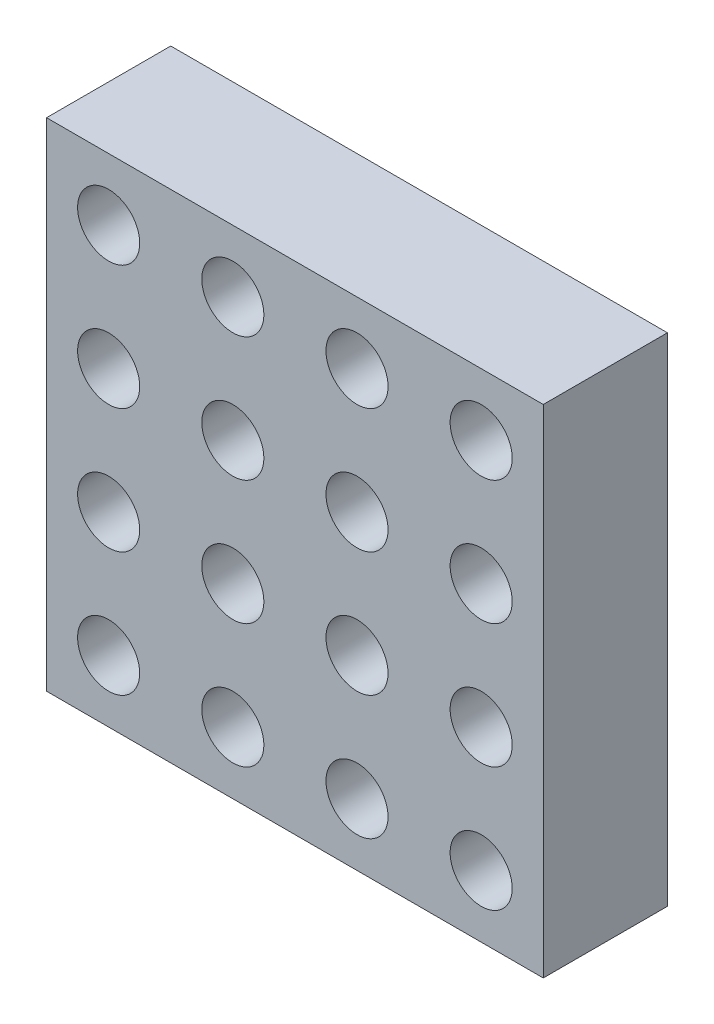
ISO-10303-21;
HEADER;
FILE_DESCRIPTION(('STEP AP214'),'2;1');
FILE_NAME('part.step','',(''),(''),'','','');
FILE_SCHEMA(('AUTOMOTIVE_DESIGN { 1 0 10303 214 1 1 1 1 }'));
ENDSEC;
DATA;
#1=APPLICATION_CONTEXT('core data for automotive mechanical design processes');
#2=APPLICATION_PROTOCOL_DEFINITION('international standard','automotive_design',2000,#1);
#3=PRODUCT_CONTEXT('',#1,'mechanical');
#4=PRODUCT('Part','Part','',(#3));
#5=PRODUCT_RELATED_PRODUCT_CATEGORY('part','',(#4));
#6=PRODUCT_DEFINITION_FORMATION('','',#4);
#7=PRODUCT_DEFINITION_CONTEXT('part definition',#1,'design');
#8=PRODUCT_DEFINITION('design','',#6,#7);
#9=PRODUCT_DEFINITION_SHAPE('','',#8);
#10=(LENGTH_UNIT() NAMED_UNIT(*) SI_UNIT(.MILLI.,.METRE.));
#11=(NAMED_UNIT(*) PLANE_ANGLE_UNIT() SI_UNIT($,.RADIAN.));
#12=(NAMED_UNIT(*) SI_UNIT($,.STERADIAN.) SOLID_ANGLE_UNIT());
#13=UNCERTAINTY_MEASURE_WITH_UNIT(LENGTH_MEASURE(1.E-05),#10,'distance_accuracy_value','');
#14=(GEOMETRIC_REPRESENTATION_CONTEXT(3) GLOBAL_UNCERTAINTY_ASSIGNED_CONTEXT((#13)) GLOBAL_UNIT_ASSIGNED_CONTEXT((#10,
#11,#12)) REPRESENTATION_CONTEXT('',''));
#15=CARTESIAN_POINT('',(0.,0.,0.));
#16=DIRECTION('',(0.,0.,1.));
#17=DIRECTION('',(1.,0.,0.));
#18=AXIS2_PLACEMENT_3D('',#15,#16,#17);
#19=CARTESIAN_POINT('',(20.,20.,10.));
#20=DIRECTION('',(-1.,0.,0.));
#21=DIRECTION('',(0.,-1.,0.));
#22=AXIS2_PLACEMENT_3D('',#19,#20,#21);
#23=PLANE('',#22);
#24=DIRECTION('',(0.,1.,0.));
#25=VECTOR('',#24,1.);
#26=CARTESIAN_POINT('',(20.,20.,0.));
#27=LINE('',#26,#25);
#28=CARTESIAN_POINT('',(20.,-20.,0.));
#29=VERTEX_POINT('',#28);
#30=CARTESIAN_POINT('',(20.,20.,0.));
#31=VERTEX_POINT('',#30);
#32=EDGE_CURVE('E104',#29,#31,#27,.T.);
#33=ORIENTED_EDGE('',*,*,#32,.T.);
#34=DIRECTION('',(0.,0.,-1.));
#35=VECTOR('',#34,1.);
#36=CARTESIAN_POINT('',(20.,20.,10.));
#37=LINE('',#36,#35);
#38=CARTESIAN_POINT('',(20.,20.,10.));
#39=VERTEX_POINT('',#38);
#40=EDGE_CURVE('E95',#39,#31,#37,.T.);
#41=ORIENTED_EDGE('',*,*,#40,.F.);
#42=DIRECTION('',(0.,1.,0.));
#43=VECTOR('',#42,1.);
#44=CARTESIAN_POINT('',(20.,20.,10.));
#45=LINE('',#44,#43);
#46=CARTESIAN_POINT('',(20.,-20.,10.));
#47=VERTEX_POINT('',#46);
#48=EDGE_CURVE('E89',#47,#39,#45,.T.);
#49=ORIENTED_EDGE('',*,*,#48,.F.);
#50=DIRECTION('',(0.,0.,-1.));
#51=VECTOR('',#50,1.);
#52=CARTESIAN_POINT('',(20.,-20.,10.));
#53=LINE('',#52,#51);
#54=EDGE_CURVE('E100',#47,#29,#53,.T.);
#55=ORIENTED_EDGE('',*,*,#54,.T.);
#56=EDGE_LOOP('',(#33,#41,#49,#55));
#57=FACE_BOUND('',#56,.T.);
#58=ADVANCED_FACE('F35',(#57),#23,.F.);
#59=CARTESIAN_POINT('',(-20.,20.,10.));
#60=DIRECTION('',(0.,-1.,0.));
#61=DIRECTION('',(0.,0.,-1.));
#62=AXIS2_PLACEMENT_3D('',#59,#60,#61);
#63=PLANE('',#62);
#64=DIRECTION('',(-1.,0.,0.));
#65=VECTOR('',#64,1.);
#66=CARTESIAN_POINT('',(-20.,20.,0.));
#67=LINE('',#66,#65);
#68=CARTESIAN_POINT('',(-20.,20.,0.));
#69=VERTEX_POINT('',#68);
#70=EDGE_CURVE('E94',#31,#69,#67,.T.);
#71=ORIENTED_EDGE('',*,*,#70,.T.);
#72=DIRECTION('',(0.,0.,-1.));
#73=VECTOR('',#72,1.);
#74=CARTESIAN_POINT('',(-20.,20.,10.));
#75=LINE('',#74,#73);
#76=CARTESIAN_POINT('',(-20.,20.,10.));
#77=VERTEX_POINT('',#76);
#78=EDGE_CURVE('E92',#77,#69,#75,.T.);
#79=ORIENTED_EDGE('',*,*,#78,.F.);
#80=DIRECTION('',(-1.,0.,0.));
#81=VECTOR('',#80,1.);
#82=CARTESIAN_POINT('',(-20.,20.,10.));
#83=LINE('',#82,#81);
#84=EDGE_CURVE('E83',#39,#77,#83,.T.);
#85=ORIENTED_EDGE('',*,*,#84,.F.);
#86=ORIENTED_EDGE('',*,*,#40,.T.);
#87=EDGE_LOOP('',(#71,#79,#85,#86));
#88=FACE_BOUND('',#87,.T.);
#89=ADVANCED_FACE('F93',(#88),#63,.F.);
#90=CARTESIAN_POINT('',(-20.,20.,10.));
#91=DIRECTION('',(1.,0.,0.));
#92=DIRECTION('',(0.,0.,-1.));
#93=AXIS2_PLACEMENT_3D('',#90,#91,#92);
#94=PLANE('',#93);
#95=DIRECTION('',(0.,-1.,0.));
#96=VECTOR('',#95,1.);
#97=CARTESIAN_POINT('',(-20.,20.,0.));
#98=LINE('',#97,#96);
#99=CARTESIAN_POINT('',(-20.,-20.,0.));
#100=VERTEX_POINT('',#99);
#101=EDGE_CURVE('E69',#69,#100,#98,.T.);
#102=ORIENTED_EDGE('',*,*,#101,.T.);
#103=DIRECTION('',(0.,0.,-1.));
#104=VECTOR('',#103,1.);
#105=CARTESIAN_POINT('',(-20.,-20.,10.));
#106=LINE('',#105,#104);
#107=CARTESIAN_POINT('',(-20.,-20.,10.));
#108=VERTEX_POINT('',#107);
#109=EDGE_CURVE('E96',#108,#100,#106,.T.);
#110=ORIENTED_EDGE('',*,*,#109,.F.);
#111=DIRECTION('',(0.,-1.,0.));
#112=VECTOR('',#111,1.);
#113=CARTESIAN_POINT('',(-20.,20.,10.));
#114=LINE('',#113,#112);
#115=EDGE_CURVE('E87',#77,#108,#114,.T.);
#116=ORIENTED_EDGE('',*,*,#115,.F.);
#117=ORIENTED_EDGE('',*,*,#78,.T.);
#118=EDGE_LOOP('',(#102,#110,#116,#117));
#119=FACE_BOUND('',#118,.T.);
#120=ADVANCED_FACE('F98',(#119),#94,.F.);
#121=CARTESIAN_POINT('',(-20.,-20.,10.));
#122=DIRECTION('',(0.,1.,0.));
#123=DIRECTION('',(0.,0.,1.));
#124=AXIS2_PLACEMENT_3D('',#121,#122,#123);
#125=PLANE('',#124);
#126=DIRECTION('',(1.,0.,0.));
#127=VECTOR('',#126,1.);
#128=CARTESIAN_POINT('',(-20.,-20.,0.));
#129=LINE('',#128,#127);
#130=EDGE_CURVE('E75',#100,#29,#129,.T.);
#131=ORIENTED_EDGE('',*,*,#130,.T.);
#132=ORIENTED_EDGE('',*,*,#54,.F.);
#133=DIRECTION('',(1.,0.,0.));
#134=VECTOR('',#133,1.);
#135=CARTESIAN_POINT('',(-20.,-20.,10.));
#136=LINE('',#135,#134);
#137=EDGE_CURVE('E52',#108,#47,#136,.T.);
#138=ORIENTED_EDGE('',*,*,#137,.F.);
#139=ORIENTED_EDGE('',*,*,#109,.T.);
#140=EDGE_LOOP('',(#131,#132,#138,#139));
#141=FACE_BOUND('',#140,.T.);
#142=ADVANCED_FACE('F202',(#141),#125,.F.);
#143=CARTESIAN_POINT('',(0.,0.,10.));
#144=DIRECTION('',(0.,0.,1.));
#145=DIRECTION('',(1.,0.,0.));
#146=AXIS2_PLACEMENT_3D('',#143,#144,#145);
#147=PLANE('',#146);
#148=CARTESIAN_POINT('',(5.,15.,10.));
#149=DIRECTION('',(0.,0.,1.));
#150=DIRECTION('',(1.,0.,0.));
#151=AXIS2_PLACEMENT_3D('',#148,#149,#150);
#152=CIRCLE('',#151,2.5);
#153=CARTESIAN_POINT('',(7.5,15.,10.));
#154=VERTEX_POINT('',#153);
#155=EDGE_CURVE('E420',#154,#154,#152,.T.);
#156=ORIENTED_EDGE('',*,*,#155,.F.);
#157=EDGE_LOOP('',(#156));
#158=FACE_BOUND('',#157,.T.);
#159=CARTESIAN_POINT('',(15.,15.,10.));
#160=DIRECTION('',(0.,0.,1.));
#161=DIRECTION('',(1.,0.,0.));
#162=AXIS2_PLACEMENT_3D('',#159,#160,#161);
#163=CIRCLE('',#162,2.5);
#164=CARTESIAN_POINT('',(17.5,15.,10.));
#165=VERTEX_POINT('',#164);
#166=EDGE_CURVE('E419',#165,#165,#163,.T.);
#167=ORIENTED_EDGE('',*,*,#166,.F.);
#168=EDGE_LOOP('',(#167));
#169=FACE_BOUND('',#168,.T.);
#170=ORIENTED_EDGE('',*,*,#48,.T.);
#171=ORIENTED_EDGE('',*,*,#84,.T.);
#172=ORIENTED_EDGE('',*,*,#115,.T.);
#173=ORIENTED_EDGE('',*,*,#137,.T.);
#174=EDGE_LOOP('',(#170,#171,#172,#173));
#175=FACE_BOUND('',#174,.T.);
#176=CARTESIAN_POINT('',(-5.,15.,10.));
#177=DIRECTION('',(0.,0.,1.));
#178=DIRECTION('',(1.,0.,0.));
#179=AXIS2_PLACEMENT_3D('',#176,#177,#178);
#180=CIRCLE('',#179,2.5);
#181=CARTESIAN_POINT('',(-2.5,15.,10.));
#182=VERTEX_POINT('',#181);
#183=EDGE_CURVE('E117',#182,#182,#180,.T.);
#184=ORIENTED_EDGE('',*,*,#183,.F.);
#185=EDGE_LOOP('',(#184));
#186=FACE_BOUND('',#185,.T.);
#187=CARTESIAN_POINT('',(-15.,15.,10.));
#188=DIRECTION('',(0.,0.,1.));
#189=DIRECTION('',(1.,0.,0.));
#190=AXIS2_PLACEMENT_3D('',#187,#188,#189);
#191=CIRCLE('',#190,2.5);
#192=CARTESIAN_POINT('',(-12.5,15.,10.));
#193=VERTEX_POINT('',#192);
#194=EDGE_CURVE('E123',#193,#193,#191,.T.);
#195=ORIENTED_EDGE('',*,*,#194,.F.);
#196=EDGE_LOOP('',(#195));
#197=FACE_BOUND('',#196,.T.);
#198=CARTESIAN_POINT('',(15.,5.,10.));
#199=DIRECTION('',(0.,0.,1.));
#200=DIRECTION('',(1.,0.,0.));
#201=AXIS2_PLACEMENT_3D('',#198,#199,#200);
#202=CIRCLE('',#201,2.5);
#203=CARTESIAN_POINT('',(17.5,5.,10.));
#204=VERTEX_POINT('',#203);
#205=EDGE_CURVE('E129',#204,#204,#202,.T.);
#206=ORIENTED_EDGE('',*,*,#205,.F.);
#207=EDGE_LOOP('',(#206));
#208=FACE_BOUND('',#207,.T.);
#209=CARTESIAN_POINT('',(5.,5.,10.));
#210=DIRECTION('',(0.,0.,1.));
#211=DIRECTION('',(1.,0.,0.));
#212=AXIS2_PLACEMENT_3D('',#209,#210,#211);
#213=CIRCLE('',#212,2.5);
#214=CARTESIAN_POINT('',(7.5,5.,10.));
#215=VERTEX_POINT('',#214);
#216=EDGE_CURVE('E135',#215,#215,#213,.T.);
#217=ORIENTED_EDGE('',*,*,#216,.F.);
#218=EDGE_LOOP('',(#217));
#219=FACE_BOUND('',#218,.T.);
#220=CARTESIAN_POINT('',(-5.,5.,10.));
#221=DIRECTION('',(0.,0.,1.));
#222=DIRECTION('',(1.,0.,0.));
#223=AXIS2_PLACEMENT_3D('',#220,#221,#222);
#224=CIRCLE('',#223,2.5);
#225=CARTESIAN_POINT('',(-2.5,5.,10.));
#226=VERTEX_POINT('',#225);
#227=EDGE_CURVE('E141',#226,#226,#224,.T.);
#228=ORIENTED_EDGE('',*,*,#227,.F.);
#229=EDGE_LOOP('',(#228));
#230=FACE_BOUND('',#229,.T.);
#231=CARTESIAN_POINT('',(-15.,5.,10.));
#232=DIRECTION('',(0.,0.,1.));
#233=DIRECTION('',(1.,0.,0.));
#234=AXIS2_PLACEMENT_3D('',#231,#232,#233);
#235=CIRCLE('',#234,2.5);
#236=CARTESIAN_POINT('',(-12.5,5.,10.));
#237=VERTEX_POINT('',#236);
#238=EDGE_CURVE('E147',#237,#237,#235,.T.);
#239=ORIENTED_EDGE('',*,*,#238,.F.);
#240=EDGE_LOOP('',(#239));
#241=FACE_BOUND('',#240,.T.);
#242=CARTESIAN_POINT('',(15.,-5.,10.));
#243=DIRECTION('',(0.,0.,1.));
#244=DIRECTION('',(1.,0.,0.));
#245=AXIS2_PLACEMENT_3D('',#242,#243,#244);
#246=CIRCLE('',#245,2.5);
#247=CARTESIAN_POINT('',(17.5,-5.,10.));
#248=VERTEX_POINT('',#247);
#249=EDGE_CURVE('E153',#248,#248,#246,.T.);
#250=ORIENTED_EDGE('',*,*,#249,.F.);
#251=EDGE_LOOP('',(#250));
#252=FACE_BOUND('',#251,.T.);
#253=CARTESIAN_POINT('',(4.99999999999999,-5.,10.));
#254=DIRECTION('',(0.,0.,1.));
#255=DIRECTION('',(1.,0.,0.));
#256=AXIS2_PLACEMENT_3D('',#253,#254,#255);
#257=CIRCLE('',#256,2.5);
#258=CARTESIAN_POINT('',(7.49999999999999,-5.,10.));
#259=VERTEX_POINT('',#258);
#260=EDGE_CURVE('E159',#259,#259,#257,.T.);
#261=ORIENTED_EDGE('',*,*,#260,.F.);
#262=EDGE_LOOP('',(#261));
#263=FACE_BOUND('',#262,.T.);
#264=CARTESIAN_POINT('',(-5.00000000000001,-5.,10.));
#265=DIRECTION('',(0.,0.,1.));
#266=DIRECTION('',(1.,0.,0.));
#267=AXIS2_PLACEMENT_3D('',#264,#265,#266);
#268=CIRCLE('',#267,2.5);
#269=CARTESIAN_POINT('',(-2.50000000000001,-5.,10.));
#270=VERTEX_POINT('',#269);
#271=EDGE_CURVE('E165',#270,#270,#268,.T.);
#272=ORIENTED_EDGE('',*,*,#271,.F.);
#273=EDGE_LOOP('',(#272));
#274=FACE_BOUND('',#273,.T.);
#275=CARTESIAN_POINT('',(-15.,-5.,10.));
#276=DIRECTION('',(0.,0.,1.));
#277=DIRECTION('',(1.,0.,0.));
#278=AXIS2_PLACEMENT_3D('',#275,#276,#277);
#279=CIRCLE('',#278,2.5);
#280=CARTESIAN_POINT('',(-12.5,-5.,10.));
#281=VERTEX_POINT('',#280);
#282=EDGE_CURVE('E171',#281,#281,#279,.T.);
#283=ORIENTED_EDGE('',*,*,#282,.F.);
#284=EDGE_LOOP('',(#283));
#285=FACE_BOUND('',#284,.T.);
#286=CARTESIAN_POINT('',(15.,-15.,10.));
#287=DIRECTION('',(0.,0.,1.));
#288=DIRECTION('',(1.,0.,0.));
#289=AXIS2_PLACEMENT_3D('',#286,#287,#288);
#290=CIRCLE('',#289,2.5);
#291=CARTESIAN_POINT('',(17.5,-15.,10.));
#292=VERTEX_POINT('',#291);
#293=EDGE_CURVE('E177',#292,#292,#290,.T.);
#294=ORIENTED_EDGE('',*,*,#293,.F.);
#295=EDGE_LOOP('',(#294));
#296=FACE_BOUND('',#295,.T.);
#297=CARTESIAN_POINT('',(4.99999999999999,-15.,10.));
#298=DIRECTION('',(0.,0.,1.));
#299=DIRECTION('',(1.,0.,0.));
#300=AXIS2_PLACEMENT_3D('',#297,#298,#299);
#301=CIRCLE('',#300,2.5);
#302=CARTESIAN_POINT('',(7.49999999999999,-15.,10.));
#303=VERTEX_POINT('',#302);
#304=EDGE_CURVE('E183',#303,#303,#301,.T.);
#305=ORIENTED_EDGE('',*,*,#304,.F.);
#306=EDGE_LOOP('',(#305));
#307=FACE_BOUND('',#306,.T.);
#308=CARTESIAN_POINT('',(-5.00000000000001,-15.,10.));
#309=DIRECTION('',(0.,0.,1.));
#310=DIRECTION('',(1.,0.,0.));
#311=AXIS2_PLACEMENT_3D('',#308,#309,#310);
#312=CIRCLE('',#311,2.5);
#313=CARTESIAN_POINT('',(-2.50000000000001,-15.,10.));
#314=VERTEX_POINT('',#313);
#315=EDGE_CURVE('E189',#314,#314,#312,.T.);
#316=ORIENTED_EDGE('',*,*,#315,.F.);
#317=EDGE_LOOP('',(#316));
#318=FACE_BOUND('',#317,.T.);
#319=CARTESIAN_POINT('',(-15.,-15.,10.));
#320=DIRECTION('',(0.,0.,1.));
#321=DIRECTION('',(1.,0.,0.));
#322=AXIS2_PLACEMENT_3D('',#319,#320,#321);
#323=CIRCLE('',#322,2.5);
#324=CARTESIAN_POINT('',(-12.5,-15.,10.));
#325=VERTEX_POINT('',#324);
#326=EDGE_CURVE('E11',#325,#325,#323,.T.);
#327=ORIENTED_EDGE('',*,*,#326,.F.);
#328=EDGE_LOOP('',(#327));
#329=FACE_BOUND('',#328,.T.);
#330=ADVANCED_FACE('F84',(#158,#169,#175,#186,#197,#208,#219,#230,#241,#252,#263,#274,#285,#296,
#307,#318,#329),#147,.T.);
#331=CARTESIAN_POINT('',(0.,0.,0.));
#332=DIRECTION('',(0.,0.,1.));
#333=DIRECTION('',(1.,0.,0.));
#334=AXIS2_PLACEMENT_3D('',#331,#332,#333);
#335=PLANE('',#334);
#336=CARTESIAN_POINT('',(5.,15.,0.));
#337=DIRECTION('',(0.,0.,1.));
#338=DIRECTION('',(1.,0.,0.));
#339=AXIS2_PLACEMENT_3D('',#336,#337,#338);
#340=CIRCLE('',#339,2.5);
#341=CARTESIAN_POINT('',(7.5,15.,0.));
#342=VERTEX_POINT('',#341);
#343=EDGE_CURVE('E424',#342,#342,#340,.T.);
#344=ORIENTED_EDGE('',*,*,#343,.T.);
#345=EDGE_LOOP('',(#344));
#346=FACE_BOUND('',#345,.T.);
#347=CARTESIAN_POINT('',(15.,15.,0.));
#348=DIRECTION('',(0.,0.,1.));
#349=DIRECTION('',(1.,0.,0.));
#350=AXIS2_PLACEMENT_3D('',#347,#348,#349);
#351=CIRCLE('',#350,2.5);
#352=CARTESIAN_POINT('',(17.5,15.,0.));
#353=VERTEX_POINT('',#352);
#354=EDGE_CURVE('E107',#353,#353,#351,.T.);
#355=ORIENTED_EDGE('',*,*,#354,.T.);
#356=EDGE_LOOP('',(#355));
#357=FACE_BOUND('',#356,.T.);
#358=ORIENTED_EDGE('',*,*,#32,.F.);
#359=ORIENTED_EDGE('',*,*,#130,.F.);
#360=ORIENTED_EDGE('',*,*,#101,.F.);
#361=ORIENTED_EDGE('',*,*,#70,.F.);
#362=EDGE_LOOP('',(#358,#359,#360,#361));
#363=FACE_BOUND('',#362,.T.);
#364=CARTESIAN_POINT('',(-5.,15.,0.));
#365=DIRECTION('',(0.,0.,1.));
#366=DIRECTION('',(1.,0.,0.));
#367=AXIS2_PLACEMENT_3D('',#364,#365,#366);
#368=CIRCLE('',#367,2.5);
#369=CARTESIAN_POINT('',(-2.5,15.,0.));
#370=VERTEX_POINT('',#369);
#371=EDGE_CURVE('E114',#370,#370,#368,.T.);
#372=ORIENTED_EDGE('',*,*,#371,.T.);
#373=EDGE_LOOP('',(#372));
#374=FACE_BOUND('',#373,.T.);
#375=CARTESIAN_POINT('',(-15.,15.,0.));
#376=DIRECTION('',(0.,0.,1.));
#377=DIRECTION('',(1.,0.,0.));
#378=AXIS2_PLACEMENT_3D('',#375,#376,#377);
#379=CIRCLE('',#378,2.5);
#380=CARTESIAN_POINT('',(-12.5,15.,0.));
#381=VERTEX_POINT('',#380);
#382=EDGE_CURVE('E120',#381,#381,#379,.T.);
#383=ORIENTED_EDGE('',*,*,#382,.T.);
#384=EDGE_LOOP('',(#383));
#385=FACE_BOUND('',#384,.T.);
#386=CARTESIAN_POINT('',(15.,5.,0.));
#387=DIRECTION('',(0.,0.,1.));
#388=DIRECTION('',(1.,0.,0.));
#389=AXIS2_PLACEMENT_3D('',#386,#387,#388);
#390=CIRCLE('',#389,2.5);
#391=CARTESIAN_POINT('',(17.5,5.,0.));
#392=VERTEX_POINT('',#391);
#393=EDGE_CURVE('E126',#392,#392,#390,.T.);
#394=ORIENTED_EDGE('',*,*,#393,.T.);
#395=EDGE_LOOP('',(#394));
#396=FACE_BOUND('',#395,.T.);
#397=CARTESIAN_POINT('',(5.,5.,0.));
#398=DIRECTION('',(0.,0.,1.));
#399=DIRECTION('',(1.,0.,0.));
#400=AXIS2_PLACEMENT_3D('',#397,#398,#399);
#401=CIRCLE('',#400,2.5);
#402=CARTESIAN_POINT('',(7.5,5.,0.));
#403=VERTEX_POINT('',#402);
#404=EDGE_CURVE('E132',#403,#403,#401,.T.);
#405=ORIENTED_EDGE('',*,*,#404,.T.);
#406=EDGE_LOOP('',(#405));
#407=FACE_BOUND('',#406,.T.);
#408=CARTESIAN_POINT('',(-5.,5.,0.));
#409=DIRECTION('',(0.,0.,1.));
#410=DIRECTION('',(1.,0.,0.));
#411=AXIS2_PLACEMENT_3D('',#408,#409,#410);
#412=CIRCLE('',#411,2.5);
#413=CARTESIAN_POINT('',(-2.5,5.,0.));
#414=VERTEX_POINT('',#413);
#415=EDGE_CURVE('E138',#414,#414,#412,.T.);
#416=ORIENTED_EDGE('',*,*,#415,.T.);
#417=EDGE_LOOP('',(#416));
#418=FACE_BOUND('',#417,.T.);
#419=CARTESIAN_POINT('',(-15.,5.,0.));
#420=DIRECTION('',(0.,0.,1.));
#421=DIRECTION('',(1.,0.,0.));
#422=AXIS2_PLACEMENT_3D('',#419,#420,#421);
#423=CIRCLE('',#422,2.5);
#424=CARTESIAN_POINT('',(-12.5,5.,0.));
#425=VERTEX_POINT('',#424);
#426=EDGE_CURVE('E144',#425,#425,#423,.T.);
#427=ORIENTED_EDGE('',*,*,#426,.T.);
#428=EDGE_LOOP('',(#427));
#429=FACE_BOUND('',#428,.T.);
#430=CARTESIAN_POINT('',(15.,-5.,0.));
#431=DIRECTION('',(0.,0.,1.));
#432=DIRECTION('',(1.,0.,0.));
#433=AXIS2_PLACEMENT_3D('',#430,#431,#432);
#434=CIRCLE('',#433,2.5);
#435=CARTESIAN_POINT('',(17.5,-5.,0.));
#436=VERTEX_POINT('',#435);
#437=EDGE_CURVE('E150',#436,#436,#434,.T.);
#438=ORIENTED_EDGE('',*,*,#437,.T.);
#439=EDGE_LOOP('',(#438));
#440=FACE_BOUND('',#439,.T.);
#441=CARTESIAN_POINT('',(4.99999999999999,-5.,0.));
#442=DIRECTION('',(0.,0.,1.));
#443=DIRECTION('',(1.,0.,0.));
#444=AXIS2_PLACEMENT_3D('',#441,#442,#443);
#445=CIRCLE('',#444,2.5);
#446=CARTESIAN_POINT('',(7.49999999999999,-5.,0.));
#447=VERTEX_POINT('',#446);
#448=EDGE_CURVE('E156',#447,#447,#445,.T.);
#449=ORIENTED_EDGE('',*,*,#448,.T.);
#450=EDGE_LOOP('',(#449));
#451=FACE_BOUND('',#450,.T.);
#452=CARTESIAN_POINT('',(-5.00000000000001,-5.,0.));
#453=DIRECTION('',(0.,0.,1.));
#454=DIRECTION('',(1.,0.,0.));
#455=AXIS2_PLACEMENT_3D('',#452,#453,#454);
#456=CIRCLE('',#455,2.5);
#457=CARTESIAN_POINT('',(-2.50000000000001,-5.,0.));
#458=VERTEX_POINT('',#457);
#459=EDGE_CURVE('E162',#458,#458,#456,.T.);
#460=ORIENTED_EDGE('',*,*,#459,.T.);
#461=EDGE_LOOP('',(#460));
#462=FACE_BOUND('',#461,.T.);
#463=CARTESIAN_POINT('',(-15.,-5.,0.));
#464=DIRECTION('',(0.,0.,1.));
#465=DIRECTION('',(1.,0.,0.));
#466=AXIS2_PLACEMENT_3D('',#463,#464,#465);
#467=CIRCLE('',#466,2.5);
#468=CARTESIAN_POINT('',(-12.5,-5.,0.));
#469=VERTEX_POINT('',#468);
#470=EDGE_CURVE('E168',#469,#469,#467,.T.);
#471=ORIENTED_EDGE('',*,*,#470,.T.);
#472=EDGE_LOOP('',(#471));
#473=FACE_BOUND('',#472,.T.);
#474=CARTESIAN_POINT('',(15.,-15.,0.));
#475=DIRECTION('',(0.,0.,1.));
#476=DIRECTION('',(1.,0.,0.));
#477=AXIS2_PLACEMENT_3D('',#474,#475,#476);
#478=CIRCLE('',#477,2.5);
#479=CARTESIAN_POINT('',(17.5,-15.,0.));
#480=VERTEX_POINT('',#479);
#481=EDGE_CURVE('E174',#480,#480,#478,.T.);
#482=ORIENTED_EDGE('',*,*,#481,.T.);
#483=EDGE_LOOP('',(#482));
#484=FACE_BOUND('',#483,.T.);
#485=CARTESIAN_POINT('',(4.99999999999999,-15.,0.));
#486=DIRECTION('',(0.,0.,1.));
#487=DIRECTION('',(1.,0.,0.));
#488=AXIS2_PLACEMENT_3D('',#485,#486,#487);
#489=CIRCLE('',#488,2.5);
#490=CARTESIAN_POINT('',(7.49999999999999,-15.,0.));
#491=VERTEX_POINT('',#490);
#492=EDGE_CURVE('E180',#491,#491,#489,.T.);
#493=ORIENTED_EDGE('',*,*,#492,.T.);
#494=EDGE_LOOP('',(#493));
#495=FACE_BOUND('',#494,.T.);
#496=CARTESIAN_POINT('',(-5.00000000000001,-15.,0.));
#497=DIRECTION('',(0.,0.,1.));
#498=DIRECTION('',(1.,0.,0.));
#499=AXIS2_PLACEMENT_3D('',#496,#497,#498);
#500=CIRCLE('',#499,2.5);
#501=CARTESIAN_POINT('',(-2.50000000000001,-15.,0.));
#502=VERTEX_POINT('',#501);
#503=EDGE_CURVE('E186',#502,#502,#500,.T.);
#504=ORIENTED_EDGE('',*,*,#503,.T.);
#505=EDGE_LOOP('',(#504));
#506=FACE_BOUND('',#505,.T.);
#507=CARTESIAN_POINT('',(-15.,-15.,0.));
#508=DIRECTION('',(0.,0.,1.));
#509=DIRECTION('',(1.,0.,0.));
#510=AXIS2_PLACEMENT_3D('',#507,#508,#509);
#511=CIRCLE('',#510,2.5);
#512=CARTESIAN_POINT('',(-12.5,-15.,0.));
#513=VERTEX_POINT('',#512);
#514=EDGE_CURVE('E44',#513,#513,#511,.T.);
#515=ORIENTED_EDGE('',*,*,#514,.T.);
#516=EDGE_LOOP('',(#515));
#517=FACE_BOUND('',#516,.T.);
#518=ADVANCED_FACE('F194',(#346,#357,#363,#374,#385,#396,#407,#418,#429,#440,#451,#462,#473,
#484,#495,#506,#517),#335,.F.);
#519=CARTESIAN_POINT('',(15.,15.,0.));
#520=DIRECTION('',(0.,0.,1.));
#521=DIRECTION('',(1.,0.,0.));
#522=AXIS2_PLACEMENT_3D('',#519,#520,#521);
#523=CYLINDRICAL_SURFACE('',#522,2.5);
#524=ORIENTED_EDGE('',*,*,#354,.F.);
#525=EDGE_LOOP('',(#524));
#526=FACE_BOUND('',#525,.T.);
#527=ORIENTED_EDGE('',*,*,#166,.T.);
#528=EDGE_LOOP('',(#527));
#529=FACE_BOUND('',#528,.T.);
#530=ADVANCED_FACE('F209',(#526,#529),#523,.F.);
#531=CARTESIAN_POINT('',(5.,15.,0.));
#532=DIRECTION('',(0.,0.,1.));
#533=DIRECTION('',(1.,0.,0.));
#534=AXIS2_PLACEMENT_3D('',#531,#532,#533);
#535=CYLINDRICAL_SURFACE('',#534,2.5);
#536=ORIENTED_EDGE('',*,*,#343,.F.);
#537=EDGE_LOOP('',(#536));
#538=FACE_BOUND('',#537,.T.);
#539=ORIENTED_EDGE('',*,*,#155,.T.);
#540=EDGE_LOOP('',(#539));
#541=FACE_BOUND('',#540,.T.);
#542=ADVANCED_FACE('F229',(#538,#541),#535,.F.);
#543=CARTESIAN_POINT('',(-5.,15.,0.));
#544=DIRECTION('',(0.,0.,1.));
#545=DIRECTION('',(1.,0.,0.));
#546=AXIS2_PLACEMENT_3D('',#543,#544,#545);
#547=CYLINDRICAL_SURFACE('',#546,2.5);
#548=ORIENTED_EDGE('',*,*,#371,.F.);
#549=EDGE_LOOP('',(#548));
#550=FACE_BOUND('',#549,.T.);
#551=ORIENTED_EDGE('',*,*,#183,.T.);
#552=EDGE_LOOP('',(#551));
#553=FACE_BOUND('',#552,.T.);
#554=ADVANCED_FACE('F225',(#550,#553),#547,.F.);
#555=CARTESIAN_POINT('',(-15.,15.,0.));
#556=DIRECTION('',(0.,0.,1.));
#557=DIRECTION('',(1.,0.,0.));
#558=AXIS2_PLACEMENT_3D('',#555,#556,#557);
#559=CYLINDRICAL_SURFACE('',#558,2.5);
#560=ORIENTED_EDGE('',*,*,#382,.F.);
#561=EDGE_LOOP('',(#560));
#562=FACE_BOUND('',#561,.T.);
#563=ORIENTED_EDGE('',*,*,#194,.T.);
#564=EDGE_LOOP('',(#563));
#565=FACE_BOUND('',#564,.T.);
#566=ADVANCED_FACE('F228',(#562,#565),#559,.F.);
#567=CARTESIAN_POINT('',(15.,5.,0.));
#568=DIRECTION('',(0.,0.,1.));
#569=DIRECTION('',(1.,0.,0.));
#570=AXIS2_PLACEMENT_3D('',#567,#568,#569);
#571=CYLINDRICAL_SURFACE('',#570,2.5);
#572=ORIENTED_EDGE('',*,*,#393,.F.);
#573=EDGE_LOOP('',(#572));
#574=FACE_BOUND('',#573,.T.);
#575=ORIENTED_EDGE('',*,*,#205,.T.);
#576=EDGE_LOOP('',(#575));
#577=FACE_BOUND('',#576,.T.);
#578=ADVANCED_FACE('F233',(#574,#577),#571,.F.);
#579=CARTESIAN_POINT('',(5.,5.,0.));
#580=DIRECTION('',(0.,0.,1.));
#581=DIRECTION('',(1.,0.,0.));
#582=AXIS2_PLACEMENT_3D('',#579,#580,#581);
#583=CYLINDRICAL_SURFACE('',#582,2.5);
#584=ORIENTED_EDGE('',*,*,#404,.F.);
#585=EDGE_LOOP('',(#584));
#586=FACE_BOUND('',#585,.T.);
#587=ORIENTED_EDGE('',*,*,#216,.T.);
#588=EDGE_LOOP('',(#587));
#589=FACE_BOUND('',#588,.T.);
#590=ADVANCED_FACE('F237',(#586,#589),#583,.F.);
#591=CARTESIAN_POINT('',(-5.,5.,0.));
#592=DIRECTION('',(0.,0.,1.));
#593=DIRECTION('',(1.,0.,0.));
#594=AXIS2_PLACEMENT_3D('',#591,#592,#593);
#595=CYLINDRICAL_SURFACE('',#594,2.5);
#596=ORIENTED_EDGE('',*,*,#415,.F.);
#597=EDGE_LOOP('',(#596));
#598=FACE_BOUND('',#597,.T.);
#599=ORIENTED_EDGE('',*,*,#227,.T.);
#600=EDGE_LOOP('',(#599));
#601=FACE_BOUND('',#600,.T.);
#602=ADVANCED_FACE('F241',(#598,#601),#595,.F.);
#603=CARTESIAN_POINT('',(-15.,5.,0.));
#604=DIRECTION('',(0.,0.,1.));
#605=DIRECTION('',(1.,0.,0.));
#606=AXIS2_PLACEMENT_3D('',#603,#604,#605);
#607=CYLINDRICAL_SURFACE('',#606,2.5);
#608=ORIENTED_EDGE('',*,*,#426,.F.);
#609=EDGE_LOOP('',(#608));
#610=FACE_BOUND('',#609,.T.);
#611=ORIENTED_EDGE('',*,*,#238,.T.);
#612=EDGE_LOOP('',(#611));
#613=FACE_BOUND('',#612,.T.);
#614=ADVANCED_FACE('F245',(#610,#613),#607,.F.);
#615=CARTESIAN_POINT('',(15.,-5.,0.));
#616=DIRECTION('',(0.,0.,1.));
#617=DIRECTION('',(1.,0.,0.));
#618=AXIS2_PLACEMENT_3D('',#615,#616,#617);
#619=CYLINDRICAL_SURFACE('',#618,2.5);
#620=ORIENTED_EDGE('',*,*,#437,.F.);
#621=EDGE_LOOP('',(#620));
#622=FACE_BOUND('',#621,.T.);
#623=ORIENTED_EDGE('',*,*,#249,.T.);
#624=EDGE_LOOP('',(#623));
#625=FACE_BOUND('',#624,.T.);
#626=ADVANCED_FACE('F249',(#622,#625),#619,.F.);
#627=CARTESIAN_POINT('',(4.99999999999999,-5.,0.));
#628=DIRECTION('',(0.,0.,1.));
#629=DIRECTION('',(1.,0.,0.));
#630=AXIS2_PLACEMENT_3D('',#627,#628,#629);
#631=CYLINDRICAL_SURFACE('',#630,2.5);
#632=ORIENTED_EDGE('',*,*,#448,.F.);
#633=EDGE_LOOP('',(#632));
#634=FACE_BOUND('',#633,.T.);
#635=ORIENTED_EDGE('',*,*,#260,.T.);
#636=EDGE_LOOP('',(#635));
#637=FACE_BOUND('',#636,.T.);
#638=ADVANCED_FACE('F253',(#634,#637),#631,.F.);
#639=CARTESIAN_POINT('',(-5.00000000000001,-5.,0.));
#640=DIRECTION('',(0.,0.,1.));
#641=DIRECTION('',(1.,0.,0.));
#642=AXIS2_PLACEMENT_3D('',#639,#640,#641);
#643=CYLINDRICAL_SURFACE('',#642,2.5);
#644=ORIENTED_EDGE('',*,*,#459,.F.);
#645=EDGE_LOOP('',(#644));
#646=FACE_BOUND('',#645,.T.);
#647=ORIENTED_EDGE('',*,*,#271,.T.);
#648=EDGE_LOOP('',(#647));
#649=FACE_BOUND('',#648,.T.);
#650=ADVANCED_FACE('F257',(#646,#649),#643,.F.);
#651=CARTESIAN_POINT('',(-15.,-5.,0.));
#652=DIRECTION('',(0.,0.,1.));
#653=DIRECTION('',(1.,0.,0.));
#654=AXIS2_PLACEMENT_3D('',#651,#652,#653);
#655=CYLINDRICAL_SURFACE('',#654,2.5);
#656=ORIENTED_EDGE('',*,*,#470,.F.);
#657=EDGE_LOOP('',(#656));
#658=FACE_BOUND('',#657,.T.);
#659=ORIENTED_EDGE('',*,*,#282,.T.);
#660=EDGE_LOOP('',(#659));
#661=FACE_BOUND('',#660,.T.);
#662=ADVANCED_FACE('F261',(#658,#661),#655,.F.);
#663=CARTESIAN_POINT('',(15.,-15.,0.));
#664=DIRECTION('',(0.,0.,1.));
#665=DIRECTION('',(1.,0.,0.));
#666=AXIS2_PLACEMENT_3D('',#663,#664,#665);
#667=CYLINDRICAL_SURFACE('',#666,2.5);
#668=ORIENTED_EDGE('',*,*,#481,.F.);
#669=EDGE_LOOP('',(#668));
#670=FACE_BOUND('',#669,.T.);
#671=ORIENTED_EDGE('',*,*,#293,.T.);
#672=EDGE_LOOP('',(#671));
#673=FACE_BOUND('',#672,.T.);
#674=ADVANCED_FACE('F265',(#670,#673),#667,.F.);
#675=CARTESIAN_POINT('',(4.99999999999999,-15.,0.));
#676=DIRECTION('',(0.,0.,1.));
#677=DIRECTION('',(1.,0.,0.));
#678=AXIS2_PLACEMENT_3D('',#675,#676,#677);
#679=CYLINDRICAL_SURFACE('',#678,2.5);
#680=ORIENTED_EDGE('',*,*,#492,.F.);
#681=EDGE_LOOP('',(#680));
#682=FACE_BOUND('',#681,.T.);
#683=ORIENTED_EDGE('',*,*,#304,.T.);
#684=EDGE_LOOP('',(#683));
#685=FACE_BOUND('',#684,.T.);
#686=ADVANCED_FACE('F269',(#682,#685),#679,.F.);
#687=CARTESIAN_POINT('',(-5.00000000000001,-15.,0.));
#688=DIRECTION('',(0.,0.,1.));
#689=DIRECTION('',(1.,0.,0.));
#690=AXIS2_PLACEMENT_3D('',#687,#688,#689);
#691=CYLINDRICAL_SURFACE('',#690,2.5);
#692=ORIENTED_EDGE('',*,*,#503,.F.);
#693=EDGE_LOOP('',(#692));
#694=FACE_BOUND('',#693,.T.);
#695=ORIENTED_EDGE('',*,*,#315,.T.);
#696=EDGE_LOOP('',(#695));
#697=FACE_BOUND('',#696,.T.);
#698=ADVANCED_FACE('F198',(#694,#697),#691,.F.);
#699=CARTESIAN_POINT('',(-15.,-15.,0.));
#700=DIRECTION('',(0.,0.,1.));
#701=DIRECTION('',(1.,0.,0.));
#702=AXIS2_PLACEMENT_3D('',#699,#700,#701);
#703=CYLINDRICAL_SURFACE('',#702,2.5);
#704=ORIENTED_EDGE('',*,*,#514,.F.);
#705=EDGE_LOOP('',(#704));
#706=FACE_BOUND('',#705,.T.);
#707=ORIENTED_EDGE('',*,*,#326,.T.);
#708=EDGE_LOOP('',(#707));
#709=FACE_BOUND('',#708,.T.);
#710=ADVANCED_FACE('F37',(#706,#709),#703,.F.);
#711=CLOSED_SHELL('',(#58,#89,#120,#142,#330,#518,#530,#542,#554,#566,#578,#590,#602,#614,#626,
#638,#650,#662,#674,#686,#698,#710));
#712=MANIFOLD_SOLID_BREP('B2',#711);
#713=ADVANCED_BREP_SHAPE_REPRESENTATION('',(#18,#712),#14);
#714=SHAPE_DEFINITION_REPRESENTATION(#9,#713);
ENDSEC;
END-ISO-10303-21;
